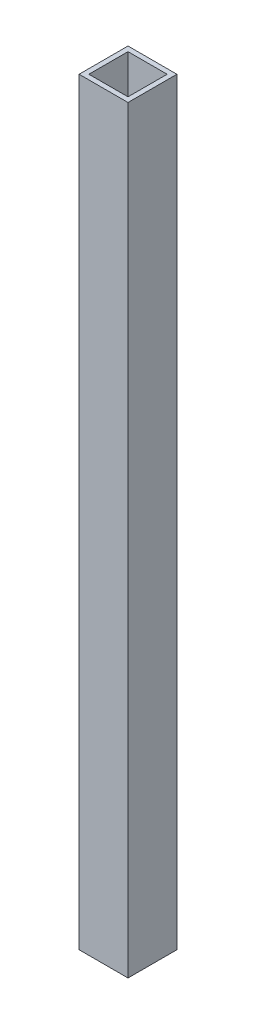
ISO-10303-21;
HEADER;
FILE_DESCRIPTION(('STEP AP214'),'2;1');
FILE_NAME('part.step','',(''),(''),'','','');
FILE_SCHEMA(('AUTOMOTIVE_DESIGN { 1 0 10303 214 1 1 1 1 }'));
ENDSEC;
DATA;
#1=APPLICATION_CONTEXT('core data for automotive mechanical design processes');
#2=APPLICATION_PROTOCOL_DEFINITION('international standard','automotive_design',2000,#1);
#3=PRODUCT_CONTEXT('',#1,'mechanical');
#4=PRODUCT('Part','Part','',(#3));
#5=PRODUCT_RELATED_PRODUCT_CATEGORY('part','',(#4));
#6=PRODUCT_DEFINITION_FORMATION('','',#4);
#7=PRODUCT_DEFINITION_CONTEXT('part definition',#1,'design');
#8=PRODUCT_DEFINITION('design','',#6,#7);
#9=PRODUCT_DEFINITION_SHAPE('','',#8);
#10=(LENGTH_UNIT() NAMED_UNIT(*) SI_UNIT(.MILLI.,.METRE.));
#11=(NAMED_UNIT(*) PLANE_ANGLE_UNIT() SI_UNIT($,.RADIAN.));
#12=(NAMED_UNIT(*) SI_UNIT($,.STERADIAN.) SOLID_ANGLE_UNIT());
#13=UNCERTAINTY_MEASURE_WITH_UNIT(LENGTH_MEASURE(1.E-05),#10,'distance_accuracy_value','');
#14=(GEOMETRIC_REPRESENTATION_CONTEXT(3) GLOBAL_UNCERTAINTY_ASSIGNED_CONTEXT((#13)) GLOBAL_UNIT_ASSIGNED_CONTEXT((#10,
#11,#12)) REPRESENTATION_CONTEXT('',''));
#15=CARTESIAN_POINT('',(0.,0.,0.));
#16=DIRECTION('',(0.,0.,1.));
#17=DIRECTION('',(1.,0.,0.));
#18=AXIS2_PLACEMENT_3D('',#15,#16,#17);
#19=CARTESIAN_POINT('',(35.,0.,-5.));
#20=DIRECTION('',(0.,0.,-1.));
#21=DIRECTION('',(-1.,0.,0.));
#22=AXIS2_PLACEMENT_3D('',#19,#20,#21);
#23=PLANE('',#22);
#24=DIRECTION('',(1.,0.,0.));
#25=VECTOR('',#24,1.);
#26=CARTESIAN_POINT('',(35.,-155.,-5.));
#27=LINE('',#26,#25);
#28=CARTESIAN_POINT('',(35.,-155.,-5.));
#29=VERTEX_POINT('',#28);
#30=CARTESIAN_POINT('',(45.,-155.,-5.));
#31=VERTEX_POINT('',#30);
#32=EDGE_CURVE('E131',#29,#31,#27,.T.);
#33=ORIENTED_EDGE('',*,*,#32,.F.);
#34=DIRECTION('',(0.,-1.,0.));
#35=VECTOR('',#34,1.);
#36=CARTESIAN_POINT('',(35.,0.,-5.));
#37=LINE('',#36,#35);
#38=CARTESIAN_POINT('',(35.,0.,-5.));
#39=VERTEX_POINT('',#38);
#40=EDGE_CURVE('E11',#39,#29,#37,.T.);
#41=ORIENTED_EDGE('',*,*,#40,.F.);
#42=DIRECTION('',(1.,0.,0.));
#43=VECTOR('',#42,1.);
#44=CARTESIAN_POINT('',(35.,0.,-5.));
#45=LINE('',#44,#43);
#46=CARTESIAN_POINT('',(45.,0.,-5.));
#47=VERTEX_POINT('',#46);
#48=EDGE_CURVE('E135',#39,#47,#45,.T.);
#49=ORIENTED_EDGE('',*,*,#48,.T.);
#50=DIRECTION('',(0.,-1.,0.));
#51=VECTOR('',#50,1.);
#52=CARTESIAN_POINT('',(45.,0.,-5.));
#53=LINE('',#52,#51);
#54=EDGE_CURVE('E36',#47,#31,#53,.T.);
#55=ORIENTED_EDGE('',*,*,#54,.T.);
#56=EDGE_LOOP('',(#33,#41,#49,#55));
#57=FACE_BOUND('',#56,.T.);
#58=ADVANCED_FACE('F33',(#57),#23,.T.);
#59=CARTESIAN_POINT('',(35.,0.,5.));
#60=DIRECTION('',(-1.,0.,0.));
#61=DIRECTION('',(0.,0.,1.));
#62=AXIS2_PLACEMENT_3D('',#59,#60,#61);
#63=PLANE('',#62);
#64=DIRECTION('',(0.,0.,-1.));
#65=VECTOR('',#64,1.);
#66=CARTESIAN_POINT('',(35.,-155.,5.));
#67=LINE('',#66,#65);
#68=CARTESIAN_POINT('',(35.,-155.,5.));
#69=VERTEX_POINT('',#68);
#70=EDGE_CURVE('E139',#69,#29,#67,.T.);
#71=ORIENTED_EDGE('',*,*,#70,.F.);
#72=DIRECTION('',(0.,-1.,0.));
#73=VECTOR('',#72,1.);
#74=CARTESIAN_POINT('',(35.,0.,5.));
#75=LINE('',#74,#73);
#76=CARTESIAN_POINT('',(35.,0.,5.));
#77=VERTEX_POINT('',#76);
#78=EDGE_CURVE('E41',#77,#69,#75,.T.);
#79=ORIENTED_EDGE('',*,*,#78,.F.);
#80=DIRECTION('',(0.,0.,-1.));
#81=VECTOR('',#80,1.);
#82=CARTESIAN_POINT('',(35.,0.,5.));
#83=LINE('',#82,#81);
#84=EDGE_CURVE('E145',#77,#39,#83,.T.);
#85=ORIENTED_EDGE('',*,*,#84,.T.);
#86=ORIENTED_EDGE('',*,*,#40,.T.);
#87=EDGE_LOOP('',(#71,#79,#85,#86));
#88=FACE_BOUND('',#87,.T.);
#89=ADVANCED_FACE('F171',(#88),#63,.T.);
#90=CARTESIAN_POINT('',(45.,0.,5.));
#91=DIRECTION('',(0.,0.,1.));
#92=DIRECTION('',(1.,0.,0.));
#93=AXIS2_PLACEMENT_3D('',#90,#91,#92);
#94=PLANE('',#93);
#95=DIRECTION('',(-1.,0.,0.));
#96=VECTOR('',#95,1.);
#97=CARTESIAN_POINT('',(45.,-155.,5.));
#98=LINE('',#97,#96);
#99=CARTESIAN_POINT('',(45.,-155.,5.));
#100=VERTEX_POINT('',#99);
#101=EDGE_CURVE('E153',#100,#69,#98,.T.);
#102=ORIENTED_EDGE('',*,*,#101,.F.);
#103=DIRECTION('',(0.,-1.,0.));
#104=VECTOR('',#103,1.);
#105=CARTESIAN_POINT('',(45.,0.,5.));
#106=LINE('',#105,#104);
#107=CARTESIAN_POINT('',(45.,0.,5.));
#108=VERTEX_POINT('',#107);
#109=EDGE_CURVE('E158',#108,#100,#106,.T.);
#110=ORIENTED_EDGE('',*,*,#109,.F.);
#111=DIRECTION('',(-1.,0.,0.));
#112=VECTOR('',#111,1.);
#113=CARTESIAN_POINT('',(45.,0.,5.));
#114=LINE('',#113,#112);
#115=EDGE_CURVE('E142',#108,#77,#114,.T.);
#116=ORIENTED_EDGE('',*,*,#115,.T.);
#117=ORIENTED_EDGE('',*,*,#78,.T.);
#118=EDGE_LOOP('',(#102,#110,#116,#117));
#119=FACE_BOUND('',#118,.T.);
#120=ADVANCED_FACE('F175',(#119),#94,.T.);
#121=CARTESIAN_POINT('',(45.,0.,-5.));
#122=DIRECTION('',(1.,0.,0.));
#123=DIRECTION('',(0.,0.,-1.));
#124=AXIS2_PLACEMENT_3D('',#121,#122,#123);
#125=PLANE('',#124);
#126=DIRECTION('',(0.,0.,1.));
#127=VECTOR('',#126,1.);
#128=CARTESIAN_POINT('',(45.,-155.,-5.));
#129=LINE('',#128,#127);
#130=EDGE_CURVE('E150',#31,#100,#129,.T.);
#131=ORIENTED_EDGE('',*,*,#130,.F.);
#132=ORIENTED_EDGE('',*,*,#54,.F.);
#133=DIRECTION('',(0.,0.,1.));
#134=VECTOR('',#133,1.);
#135=CARTESIAN_POINT('',(45.,0.,-5.));
#136=LINE('',#135,#134);
#137=EDGE_CURVE('E138',#47,#108,#136,.T.);
#138=ORIENTED_EDGE('',*,*,#137,.T.);
#139=ORIENTED_EDGE('',*,*,#109,.T.);
#140=EDGE_LOOP('',(#131,#132,#138,#139));
#141=FACE_BOUND('',#140,.T.);
#142=ADVANCED_FACE('F166',(#141),#125,.T.);
#143=CARTESIAN_POINT('',(0.,0.,0.));
#144=DIRECTION('',(0.,-1.,0.));
#145=DIRECTION('',(0.,0.,-1.));
#146=AXIS2_PLACEMENT_3D('',#143,#144,#145);
#147=PLANE('',#146);
#148=DIRECTION('',(0.,0.,1.));
#149=VECTOR('',#148,1.);
#150=CARTESIAN_POINT('',(44.,0.,4.));
#151=LINE('',#150,#149);
#152=CARTESIAN_POINT('',(44.,0.,-4.));
#153=VERTEX_POINT('',#152);
#154=CARTESIAN_POINT('',(44.,0.,4.));
#155=VERTEX_POINT('',#154);
#156=EDGE_CURVE('E106',#153,#155,#151,.T.);
#157=ORIENTED_EDGE('',*,*,#156,.T.);
#158=DIRECTION('',(-1.,0.,0.));
#159=VECTOR('',#158,1.);
#160=CARTESIAN_POINT('',(36.,0.,4.));
#161=LINE('',#160,#159);
#162=CARTESIAN_POINT('',(36.,0.,4.));
#163=VERTEX_POINT('',#162);
#164=EDGE_CURVE('E100',#155,#163,#161,.T.);
#165=ORIENTED_EDGE('',*,*,#164,.T.);
#166=DIRECTION('',(0.,0.,-1.));
#167=VECTOR('',#166,1.);
#168=CARTESIAN_POINT('',(36.,0.,-4.));
#169=LINE('',#168,#167);
#170=CARTESIAN_POINT('',(36.,0.,-4.));
#171=VERTEX_POINT('',#170);
#172=EDGE_CURVE('E109',#163,#171,#169,.T.);
#173=ORIENTED_EDGE('',*,*,#172,.T.);
#174=DIRECTION('',(1.,0.,0.));
#175=VECTOR('',#174,1.);
#176=CARTESIAN_POINT('',(44.,0.,-4.));
#177=LINE('',#176,#175);
#178=EDGE_CURVE('E49',#171,#153,#177,.T.);
#179=ORIENTED_EDGE('',*,*,#178,.T.);
#180=EDGE_LOOP('',(#157,#165,#173,#179));
#181=FACE_BOUND('',#180,.T.);
#182=ORIENTED_EDGE('',*,*,#48,.F.);
#183=ORIENTED_EDGE('',*,*,#84,.F.);
#184=ORIENTED_EDGE('',*,*,#115,.F.);
#185=ORIENTED_EDGE('',*,*,#137,.F.);
#186=EDGE_LOOP('',(#182,#183,#184,#185));
#187=FACE_BOUND('',#186,.T.);
#188=ADVANCED_FACE('F113',(#181,#187),#147,.F.);
#189=CARTESIAN_POINT('',(0.,-155.,0.));
#190=DIRECTION('',(0.,-1.,0.));
#191=DIRECTION('',(0.,0.,-1.));
#192=AXIS2_PLACEMENT_3D('',#189,#190,#191);
#193=PLANE('',#192);
#194=DIRECTION('',(-1.,0.,0.));
#195=VECTOR('',#194,1.);
#196=CARTESIAN_POINT('',(36.,-155.,4.));
#197=LINE('',#196,#195);
#198=CARTESIAN_POINT('',(44.,-155.,4.));
#199=VERTEX_POINT('',#198);
#200=CARTESIAN_POINT('',(36.,-155.,4.));
#201=VERTEX_POINT('',#200);
#202=EDGE_CURVE('E57',#199,#201,#197,.T.);
#203=ORIENTED_EDGE('',*,*,#202,.F.);
#204=DIRECTION('',(0.,0.,1.));
#205=VECTOR('',#204,1.);
#206=CARTESIAN_POINT('',(44.,-155.,4.));
#207=LINE('',#206,#205);
#208=CARTESIAN_POINT('',(44.,-155.,-4.));
#209=VERTEX_POINT('',#208);
#210=EDGE_CURVE('E116',#209,#199,#207,.T.);
#211=ORIENTED_EDGE('',*,*,#210,.F.);
#212=DIRECTION('',(1.,0.,0.));
#213=VECTOR('',#212,1.);
#214=CARTESIAN_POINT('',(44.,-155.,-4.));
#215=LINE('',#214,#213);
#216=CARTESIAN_POINT('',(36.,-155.,-4.));
#217=VERTEX_POINT('',#216);
#218=EDGE_CURVE('E119',#217,#209,#215,.T.);
#219=ORIENTED_EDGE('',*,*,#218,.F.);
#220=DIRECTION('',(0.,0.,-1.));
#221=VECTOR('',#220,1.);
#222=CARTESIAN_POINT('',(36.,-155.,-4.));
#223=LINE('',#222,#221);
#224=EDGE_CURVE('E125',#201,#217,#223,.T.);
#225=ORIENTED_EDGE('',*,*,#224,.F.);
#226=EDGE_LOOP('',(#203,#211,#219,#225));
#227=FACE_BOUND('',#226,.T.);
#228=ORIENTED_EDGE('',*,*,#32,.T.);
#229=ORIENTED_EDGE('',*,*,#130,.T.);
#230=ORIENTED_EDGE('',*,*,#101,.T.);
#231=ORIENTED_EDGE('',*,*,#70,.T.);
#232=EDGE_LOOP('',(#228,#229,#230,#231));
#233=FACE_BOUND('',#232,.T.);
#234=ADVANCED_FACE('F168',(#227,#233),#193,.T.);
#235=CARTESIAN_POINT('',(36.,0.,4.));
#236=DIRECTION('',(0.,0.,1.));
#237=DIRECTION('',(1.,0.,0.));
#238=AXIS2_PLACEMENT_3D('',#235,#236,#237);
#239=PLANE('',#238);
#240=ORIENTED_EDGE('',*,*,#202,.T.);
#241=DIRECTION('',(0.,-1.,0.));
#242=VECTOR('',#241,1.);
#243=CARTESIAN_POINT('',(36.,0.,4.));
#244=LINE('',#243,#242);
#245=EDGE_CURVE('E96',#163,#201,#244,.T.);
#246=ORIENTED_EDGE('',*,*,#245,.F.);
#247=ORIENTED_EDGE('',*,*,#164,.F.);
#248=DIRECTION('',(0.,-1.,0.));
#249=VECTOR('',#248,1.);
#250=CARTESIAN_POINT('',(44.,0.,4.));
#251=LINE('',#250,#249);
#252=EDGE_CURVE('E129',#155,#199,#251,.T.);
#253=ORIENTED_EDGE('',*,*,#252,.T.);
#254=EDGE_LOOP('',(#240,#246,#247,#253));
#255=FACE_BOUND('',#254,.T.);
#256=ADVANCED_FACE('F98',(#255),#239,.F.);
#257=CARTESIAN_POINT('',(44.,0.,4.));
#258=DIRECTION('',(1.,0.,0.));
#259=DIRECTION('',(0.,0.,-1.));
#260=AXIS2_PLACEMENT_3D('',#257,#258,#259);
#261=PLANE('',#260);
#262=ORIENTED_EDGE('',*,*,#210,.T.);
#263=ORIENTED_EDGE('',*,*,#252,.F.);
#264=ORIENTED_EDGE('',*,*,#156,.F.);
#265=DIRECTION('',(0.,-1.,0.));
#266=VECTOR('',#265,1.);
#267=CARTESIAN_POINT('',(44.,0.,-4.));
#268=LINE('',#267,#266);
#269=EDGE_CURVE('E132',#153,#209,#268,.T.);
#270=ORIENTED_EDGE('',*,*,#269,.T.);
#271=EDGE_LOOP('',(#262,#263,#264,#270));
#272=FACE_BOUND('',#271,.T.);
#273=ADVANCED_FACE('F226',(#272),#261,.F.);
#274=CARTESIAN_POINT('',(44.,0.,-4.));
#275=DIRECTION('',(0.,0.,-1.));
#276=DIRECTION('',(-1.,0.,0.));
#277=AXIS2_PLACEMENT_3D('',#274,#275,#276);
#278=PLANE('',#277);
#279=ORIENTED_EDGE('',*,*,#218,.T.);
#280=ORIENTED_EDGE('',*,*,#269,.F.);
#281=ORIENTED_EDGE('',*,*,#178,.F.);
#282=DIRECTION('',(0.,-1.,0.));
#283=VECTOR('',#282,1.);
#284=CARTESIAN_POINT('',(36.,0.,-4.));
#285=LINE('',#284,#283);
#286=EDGE_CURVE('E105',#171,#217,#285,.T.);
#287=ORIENTED_EDGE('',*,*,#286,.T.);
#288=EDGE_LOOP('',(#279,#280,#281,#287));
#289=FACE_BOUND('',#288,.T.);
#290=ADVANCED_FACE('F235',(#289),#278,.F.);
#291=CARTESIAN_POINT('',(36.,0.,-4.));
#292=DIRECTION('',(-1.,0.,0.));
#293=DIRECTION('',(0.,0.,1.));
#294=AXIS2_PLACEMENT_3D('',#291,#292,#293);
#295=PLANE('',#294);
#296=ORIENTED_EDGE('',*,*,#224,.T.);
#297=ORIENTED_EDGE('',*,*,#286,.F.);
#298=ORIENTED_EDGE('',*,*,#172,.F.);
#299=ORIENTED_EDGE('',*,*,#245,.T.);
#300=EDGE_LOOP('',(#296,#297,#298,#299));
#301=FACE_BOUND('',#300,.T.);
#302=ADVANCED_FACE('F110',(#301),#295,.F.);
#303=CLOSED_SHELL('',(#58,#89,#120,#142,#188,#234,#256,#273,#290,#302));
#304=MANIFOLD_SOLID_BREP('B2',#303);
#305=ADVANCED_BREP_SHAPE_REPRESENTATION('',(#18,#304),#14);
#306=SHAPE_DEFINITION_REPRESENTATION(#9,#305);
ENDSEC;
END-ISO-10303-21;
